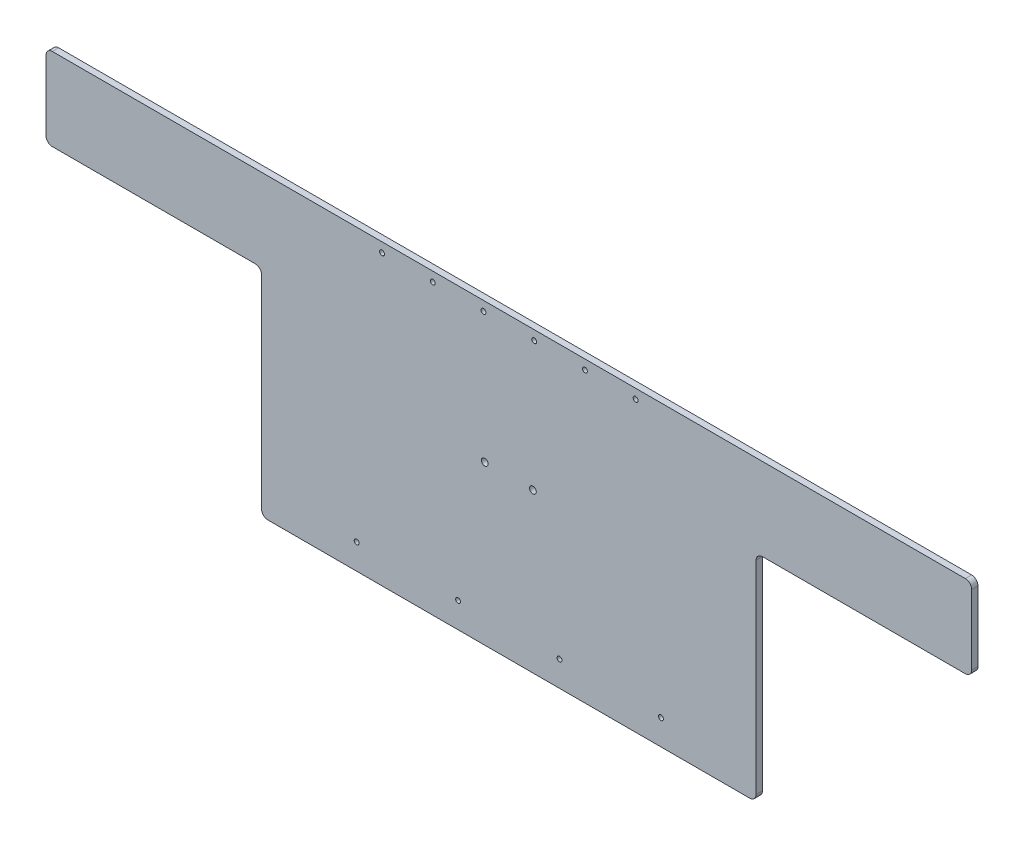
ISO-10303-21;
HEADER;
FILE_DESCRIPTION(('STEP AP214'),'2;1');
FILE_NAME('part.step','',(''),(''),'','','');
FILE_SCHEMA(('AUTOMOTIVE_DESIGN { 1 0 10303 214 1 1 1 1 }'));
ENDSEC;
DATA;
#1=APPLICATION_CONTEXT('core data for automotive mechanical design processes');
#2=APPLICATION_PROTOCOL_DEFINITION('international standard','automotive_design',2000,#1);
#3=PRODUCT_CONTEXT('',#1,'mechanical');
#4=PRODUCT('Part','Part','',(#3));
#5=PRODUCT_RELATED_PRODUCT_CATEGORY('part','',(#4));
#6=PRODUCT_DEFINITION_FORMATION('','',#4);
#7=PRODUCT_DEFINITION_CONTEXT('part definition',#1,'design');
#8=PRODUCT_DEFINITION('design','',#6,#7);
#9=PRODUCT_DEFINITION_SHAPE('','',#8);
#10=(LENGTH_UNIT() NAMED_UNIT(*) SI_UNIT(.MILLI.,.METRE.));
#11=(NAMED_UNIT(*) PLANE_ANGLE_UNIT() SI_UNIT($,.RADIAN.));
#12=(NAMED_UNIT(*) SI_UNIT($,.STERADIAN.) SOLID_ANGLE_UNIT());
#13=UNCERTAINTY_MEASURE_WITH_UNIT(LENGTH_MEASURE(1.E-05),#10,'distance_accuracy_value','');
#14=(GEOMETRIC_REPRESENTATION_CONTEXT(3) GLOBAL_UNCERTAINTY_ASSIGNED_CONTEXT((#13)) GLOBAL_UNIT_ASSIGNED_CONTEXT((#10,
#11,#12)) REPRESENTATION_CONTEXT('',''));
#15=CARTESIAN_POINT('',(0.,0.,0.));
#16=DIRECTION('',(0.,0.,1.));
#17=DIRECTION('',(1.,0.,0.));
#18=AXIS2_PLACEMENT_3D('',#15,#16,#17);
#19=CARTESIAN_POINT('',(152.4,-273.05,0.));
#20=DIRECTION('',(0.,0.,1.));
#21=DIRECTION('',(1.,0.,0.));
#22=AXIS2_PLACEMENT_3D('',#19,#20,#21);
#23=CYLINDRICAL_SURFACE('',#22,2.4638);
#24=CARTESIAN_POINT('',(152.4,-273.05,0.));
#25=DIRECTION('',(0.,0.,1.));
#26=DIRECTION('',(1.,0.,0.));
#27=AXIS2_PLACEMENT_3D('',#24,#25,#26);
#28=CIRCLE('',#27,2.4638);
#29=CARTESIAN_POINT('',(154.8638,-273.05,0.));
#30=VERTEX_POINT('',#29);
#31=EDGE_CURVE('E218',#30,#30,#28,.T.);
#32=ORIENTED_EDGE('',*,*,#31,.F.);
#33=EDGE_LOOP('',(#32));
#34=FACE_BOUND('',#33,.T.);
#35=CARTESIAN_POINT('',(152.4,-273.05,6.35));
#36=DIRECTION('',(0.,0.,1.));
#37=DIRECTION('',(1.,0.,0.));
#38=AXIS2_PLACEMENT_3D('',#35,#36,#37);
#39=CIRCLE('',#38,2.4638);
#40=CARTESIAN_POINT('',(154.8638,-273.05,6.35));
#41=VERTEX_POINT('',#40);
#42=EDGE_CURVE('E221',#41,#41,#39,.T.);
#43=ORIENTED_EDGE('',*,*,#42,.T.);
#44=EDGE_LOOP('',(#43));
#45=FACE_BOUND('',#44,.T.);
#46=ADVANCED_FACE('F37',(#34,#45),#23,.F.);
#47=CARTESIAN_POINT('',(50.8,-273.05,0.));
#48=DIRECTION('',(0.,0.,1.));
#49=DIRECTION('',(1.,0.,0.));
#50=AXIS2_PLACEMENT_3D('',#47,#48,#49);
#51=CYLINDRICAL_SURFACE('',#50,2.4638);
#52=CARTESIAN_POINT('',(50.8,-273.05,0.));
#53=DIRECTION('',(0.,0.,1.));
#54=DIRECTION('',(1.,0.,0.));
#55=AXIS2_PLACEMENT_3D('',#52,#53,#54);
#56=CIRCLE('',#55,2.4638);
#57=CARTESIAN_POINT('',(53.2638,-273.05,0.));
#58=VERTEX_POINT('',#57);
#59=EDGE_CURVE('E212',#58,#58,#56,.T.);
#60=ORIENTED_EDGE('',*,*,#59,.F.);
#61=EDGE_LOOP('',(#60));
#62=FACE_BOUND('',#61,.T.);
#63=CARTESIAN_POINT('',(50.8,-273.05,6.35));
#64=DIRECTION('',(0.,0.,1.));
#65=DIRECTION('',(1.,0.,0.));
#66=AXIS2_PLACEMENT_3D('',#63,#64,#65);
#67=CIRCLE('',#66,2.4638);
#68=CARTESIAN_POINT('',(53.2638,-273.05,6.35));
#69=VERTEX_POINT('',#68);
#70=EDGE_CURVE('E215',#69,#69,#67,.T.);
#71=ORIENTED_EDGE('',*,*,#70,.T.);
#72=EDGE_LOOP('',(#71));
#73=FACE_BOUND('',#72,.T.);
#74=ADVANCED_FACE('F343',(#62,#73),#51,.F.);
#75=CARTESIAN_POINT('',(-127.,-9.52500000000003,0.));
#76=DIRECTION('',(0.,0.,1.));
#77=DIRECTION('',(1.,0.,0.));
#78=AXIS2_PLACEMENT_3D('',#75,#76,#77);
#79=CYLINDRICAL_SURFACE('',#78,2.4638);
#80=CARTESIAN_POINT('',(-127.,-9.52500000000003,0.));
#81=DIRECTION('',(0.,0.,1.));
#82=DIRECTION('',(1.,0.,0.));
#83=AXIS2_PLACEMENT_3D('',#80,#81,#82);
#84=CIRCLE('',#83,2.4638);
#85=CARTESIAN_POINT('',(-124.5362,-9.52500000000003,0.));
#86=VERTEX_POINT('',#85);
#87=EDGE_CURVE('E206',#86,#86,#84,.T.);
#88=ORIENTED_EDGE('',*,*,#87,.F.);
#89=EDGE_LOOP('',(#88));
#90=FACE_BOUND('',#89,.T.);
#91=CARTESIAN_POINT('',(-127.,-9.52500000000003,6.35));
#92=DIRECTION('',(0.,0.,1.));
#93=DIRECTION('',(1.,0.,0.));
#94=AXIS2_PLACEMENT_3D('',#91,#92,#93);
#95=CIRCLE('',#94,2.4638);
#96=CARTESIAN_POINT('',(-124.5362,-9.52500000000003,6.35));
#97=VERTEX_POINT('',#96);
#98=EDGE_CURVE('E209',#97,#97,#95,.T.);
#99=ORIENTED_EDGE('',*,*,#98,.T.);
#100=EDGE_LOOP('',(#99));
#101=FACE_BOUND('',#100,.T.);
#102=ADVANCED_FACE('F349',(#90,#101),#79,.F.);
#103=CARTESIAN_POINT('',(-76.2,-9.52500000000003,0.));
#104=DIRECTION('',(0.,0.,1.));
#105=DIRECTION('',(1.,0.,0.));
#106=AXIS2_PLACEMENT_3D('',#103,#104,#105);
#107=CYLINDRICAL_SURFACE('',#106,2.4638);
#108=CARTESIAN_POINT('',(-76.2,-9.52500000000003,0.));
#109=DIRECTION('',(0.,0.,1.));
#110=DIRECTION('',(1.,0.,0.));
#111=AXIS2_PLACEMENT_3D('',#108,#109,#110);
#112=CIRCLE('',#111,2.4638);
#113=CARTESIAN_POINT('',(-73.7362,-9.52500000000003,0.));
#114=VERTEX_POINT('',#113);
#115=EDGE_CURVE('E200',#114,#114,#112,.T.);
#116=ORIENTED_EDGE('',*,*,#115,.F.);
#117=EDGE_LOOP('',(#116));
#118=FACE_BOUND('',#117,.T.);
#119=CARTESIAN_POINT('',(-76.2,-9.52500000000003,6.35));
#120=DIRECTION('',(0.,0.,1.));
#121=DIRECTION('',(1.,0.,0.));
#122=AXIS2_PLACEMENT_3D('',#119,#120,#121);
#123=CIRCLE('',#122,2.4638);
#124=CARTESIAN_POINT('',(-73.7362,-9.52500000000003,6.35));
#125=VERTEX_POINT('',#124);
#126=EDGE_CURVE('E203',#125,#125,#123,.T.);
#127=ORIENTED_EDGE('',*,*,#126,.T.);
#128=EDGE_LOOP('',(#127));
#129=FACE_BOUND('',#128,.T.);
#130=ADVANCED_FACE('F587',(#118,#129),#107,.F.);
#131=CARTESIAN_POINT('',(-25.4,-9.52500000000003,0.));
#132=DIRECTION('',(0.,0.,1.));
#133=DIRECTION('',(1.,0.,0.));
#134=AXIS2_PLACEMENT_3D('',#131,#132,#133);
#135=CYLINDRICAL_SURFACE('',#134,2.4638);
#136=CARTESIAN_POINT('',(-25.4,-9.52500000000003,0.));
#137=DIRECTION('',(0.,0.,1.));
#138=DIRECTION('',(1.,0.,0.));
#139=AXIS2_PLACEMENT_3D('',#136,#137,#138);
#140=CIRCLE('',#139,2.4638);
#141=CARTESIAN_POINT('',(-22.9362,-9.52500000000003,0.));
#142=VERTEX_POINT('',#141);
#143=EDGE_CURVE('E194',#142,#142,#140,.T.);
#144=ORIENTED_EDGE('',*,*,#143,.F.);
#145=EDGE_LOOP('',(#144));
#146=FACE_BOUND('',#145,.T.);
#147=CARTESIAN_POINT('',(-25.4,-9.52500000000003,6.35));
#148=DIRECTION('',(0.,0.,1.));
#149=DIRECTION('',(1.,0.,0.));
#150=AXIS2_PLACEMENT_3D('',#147,#148,#149);
#151=CIRCLE('',#150,2.4638);
#152=CARTESIAN_POINT('',(-22.9362,-9.52500000000003,6.35));
#153=VERTEX_POINT('',#152);
#154=EDGE_CURVE('E197',#153,#153,#151,.T.);
#155=ORIENTED_EDGE('',*,*,#154,.T.);
#156=EDGE_LOOP('',(#155));
#157=FACE_BOUND('',#156,.T.);
#158=ADVANCED_FACE('F577',(#146,#157),#135,.F.);
#159=CARTESIAN_POINT('',(25.4,-9.52500000000003,0.));
#160=DIRECTION('',(0.,0.,1.));
#161=DIRECTION('',(1.,0.,0.));
#162=AXIS2_PLACEMENT_3D('',#159,#160,#161);
#163=CYLINDRICAL_SURFACE('',#162,2.4638);
#164=CARTESIAN_POINT('',(25.4,-9.52500000000003,0.));
#165=DIRECTION('',(0.,0.,1.));
#166=DIRECTION('',(1.,0.,0.));
#167=AXIS2_PLACEMENT_3D('',#164,#165,#166);
#168=CIRCLE('',#167,2.4638);
#169=CARTESIAN_POINT('',(27.8638,-9.52500000000003,0.));
#170=VERTEX_POINT('',#169);
#171=EDGE_CURVE('E188',#170,#170,#168,.T.);
#172=ORIENTED_EDGE('',*,*,#171,.F.);
#173=EDGE_LOOP('',(#172));
#174=FACE_BOUND('',#173,.T.);
#175=CARTESIAN_POINT('',(25.4,-9.52500000000003,6.35));
#176=DIRECTION('',(0.,0.,1.));
#177=DIRECTION('',(1.,0.,0.));
#178=AXIS2_PLACEMENT_3D('',#175,#176,#177);
#179=CIRCLE('',#178,2.4638);
#180=CARTESIAN_POINT('',(27.8638,-9.52500000000003,6.35));
#181=VERTEX_POINT('',#180);
#182=EDGE_CURVE('E191',#181,#181,#179,.T.);
#183=ORIENTED_EDGE('',*,*,#182,.T.);
#184=EDGE_LOOP('',(#183));
#185=FACE_BOUND('',#184,.T.);
#186=ADVANCED_FACE('F509',(#174,#185),#163,.F.);
#187=CARTESIAN_POINT('',(-247.65,-82.5500000000001,6.35));
#188=DIRECTION('',(0.,1.,0.));
#189=DIRECTION('',(-1.,0.,0.));
#190=AXIS2_PLACEMENT_3D('',#187,#188,#189);
#191=PLANE('',#190);
#192=DIRECTION('',(1.,0.,0.));
#193=VECTOR('',#192,1.);
#194=CARTESIAN_POINT('',(-247.65,-82.5500000000001,6.35));
#195=LINE('',#194,#193);
#196=CARTESIAN_POINT('',(-457.2,-82.5500000000002,6.35));
#197=VERTEX_POINT('',#196);
#198=CARTESIAN_POINT('',(-254.,-82.5500000000001,6.35));
#199=VERTEX_POINT('',#198);
#200=EDGE_CURVE('E178',#197,#199,#195,.T.);
#201=ORIENTED_EDGE('',*,*,#200,.F.);
#202=DIRECTION('',(0.,0.,-1.));
#203=VECTOR('',#202,1.);
#204=CARTESIAN_POINT('',(-457.2,-82.5500000000002,6.35));
#205=LINE('',#204,#203);
#206=CARTESIAN_POINT('',(-457.2,-82.5500000000002,0.));
#207=VERTEX_POINT('',#206);
#208=EDGE_CURVE('E249',#197,#207,#205,.T.);
#209=ORIENTED_EDGE('',*,*,#208,.T.);
#210=DIRECTION('',(1.,0.,0.));
#211=VECTOR('',#210,1.);
#212=CARTESIAN_POINT('',(-247.65,-82.5500000000001,0.));
#213=LINE('',#212,#211);
#214=CARTESIAN_POINT('',(-254.,-82.5500000000001,0.));
#215=VERTEX_POINT('',#214);
#216=EDGE_CURVE('E315',#207,#215,#213,.T.);
#217=ORIENTED_EDGE('',*,*,#216,.T.);
#218=DIRECTION('',(0.,0.,-1.));
#219=VECTOR('',#218,1.);
#220=CARTESIAN_POINT('',(-254.,-82.5500000000001,6.35));
#221=LINE('',#220,#219);
#222=EDGE_CURVE('E247',#215,#199,#221,.F.);
#223=ORIENTED_EDGE('',*,*,#222,.T.);
#224=EDGE_LOOP('',(#201,#209,#217,#223));
#225=FACE_BOUND('',#224,.T.);
#226=ADVANCED_FACE('F499',(#225),#191,.F.);
#227=CARTESIAN_POINT('',(-247.65,-298.45,6.35));
#228=DIRECTION('',(1.,0.,0.));
#229=DIRECTION('',(0.,1.,0.));
#230=AXIS2_PLACEMENT_3D('',#227,#228,#229);
#231=PLANE('',#230);
#232=DIRECTION('',(0.,-1.,0.));
#233=VECTOR('',#232,1.);
#234=CARTESIAN_POINT('',(-247.65,-298.45,6.35));
#235=LINE('',#234,#233);
#236=CARTESIAN_POINT('',(-247.65,-88.9000000000001,6.35));
#237=VERTEX_POINT('',#236);
#238=CARTESIAN_POINT('',(-247.65,-292.1,6.35));
#239=VERTEX_POINT('',#238);
#240=EDGE_CURVE('E182',#237,#239,#235,.T.);
#241=ORIENTED_EDGE('',*,*,#240,.F.);
#242=DIRECTION('',(0.,0.,-1.));
#243=VECTOR('',#242,1.);
#244=CARTESIAN_POINT('',(-247.65,-88.9000000000001,0.));
#245=LINE('',#244,#243);
#246=CARTESIAN_POINT('',(-247.65,-88.9000000000001,0.));
#247=VERTEX_POINT('',#246);
#248=EDGE_CURVE('E254',#237,#247,#245,.T.);
#249=ORIENTED_EDGE('',*,*,#248,.T.);
#250=DIRECTION('',(0.,-1.,0.));
#251=VECTOR('',#250,1.);
#252=CARTESIAN_POINT('',(-247.65,-298.45,0.));
#253=LINE('',#252,#251);
#254=CARTESIAN_POINT('',(-247.65,-292.1,0.));
#255=VERTEX_POINT('',#254);
#256=EDGE_CURVE('E318',#247,#255,#253,.T.);
#257=ORIENTED_EDGE('',*,*,#256,.T.);
#258=DIRECTION('',(0.,0.,-1.));
#259=VECTOR('',#258,1.);
#260=CARTESIAN_POINT('',(-247.65,-292.1,6.35));
#261=LINE('',#260,#259);
#262=EDGE_CURVE('E252',#255,#239,#261,.F.);
#263=ORIENTED_EDGE('',*,*,#262,.T.);
#264=EDGE_LOOP('',(#241,#249,#257,#263));
#265=FACE_BOUND('',#264,.T.);
#266=ADVANCED_FACE('F489',(#265),#231,.F.);
#267=CARTESIAN_POINT('',(247.65,-298.45,6.35));
#268=DIRECTION('',(0.,1.,0.));
#269=DIRECTION('',(0.,0.,1.));
#270=AXIS2_PLACEMENT_3D('',#267,#268,#269);
#271=PLANE('',#270);
#272=DIRECTION('',(1.,0.,0.));
#273=VECTOR('',#272,1.);
#274=CARTESIAN_POINT('',(247.65,-298.45,6.35));
#275=LINE('',#274,#273);
#276=CARTESIAN_POINT('',(-241.3,-298.45,6.35));
#277=VERTEX_POINT('',#276);
#278=CARTESIAN_POINT('',(241.3,-298.45,6.35));
#279=VERTEX_POINT('',#278);
#280=EDGE_CURVE('E309',#277,#279,#275,.T.);
#281=ORIENTED_EDGE('',*,*,#280,.F.);
#282=DIRECTION('',(0.,0.,-1.));
#283=VECTOR('',#282,1.);
#284=CARTESIAN_POINT('',(-241.3,-298.45,6.35));
#285=LINE('',#284,#283);
#286=CARTESIAN_POINT('',(-241.3,-298.45,0.));
#287=VERTEX_POINT('',#286);
#288=EDGE_CURVE('E259',#277,#287,#285,.T.);
#289=ORIENTED_EDGE('',*,*,#288,.T.);
#290=DIRECTION('',(1.,0.,0.));
#291=VECTOR('',#290,1.);
#292=CARTESIAN_POINT('',(247.65,-298.45,0.));
#293=LINE('',#292,#291);
#294=CARTESIAN_POINT('',(241.3,-298.45,0.));
#295=VERTEX_POINT('',#294);
#296=EDGE_CURVE('E293',#287,#295,#293,.T.);
#297=ORIENTED_EDGE('',*,*,#296,.T.);
#298=DIRECTION('',(0.,0.,-1.));
#299=VECTOR('',#298,1.);
#300=CARTESIAN_POINT('',(241.3,-298.45,6.35));
#301=LINE('',#300,#299);
#302=EDGE_CURVE('E257',#295,#279,#301,.F.);
#303=ORIENTED_EDGE('',*,*,#302,.T.);
#304=EDGE_LOOP('',(#281,#289,#297,#303));
#305=FACE_BOUND('',#304,.T.);
#306=ADVANCED_FACE('F480',(#305),#271,.F.);
#307=CARTESIAN_POINT('',(247.65,-82.5500000000001,6.35));
#308=DIRECTION('',(-1.,0.,0.));
#309=DIRECTION('',(0.,-1.,0.));
#310=AXIS2_PLACEMENT_3D('',#307,#308,#309);
#311=PLANE('',#310);
#312=DIRECTION('',(0.,1.,0.));
#313=VECTOR('',#312,1.);
#314=CARTESIAN_POINT('',(247.65,-82.5500000000001,6.35));
#315=LINE('',#314,#313);
#316=CARTESIAN_POINT('',(247.65,-292.1,6.35));
#317=VERTEX_POINT('',#316);
#318=CARTESIAN_POINT('',(247.65,-88.9000000000001,6.35));
#319=VERTEX_POINT('',#318);
#320=EDGE_CURVE('E301',#317,#319,#315,.T.);
#321=ORIENTED_EDGE('',*,*,#320,.F.);
#322=DIRECTION('',(0.,0.,-1.));
#323=VECTOR('',#322,1.);
#324=CARTESIAN_POINT('',(247.65,-292.1,6.35));
#325=LINE('',#324,#323);
#326=CARTESIAN_POINT('',(247.65,-292.1,0.));
#327=VERTEX_POINT('',#326);
#328=EDGE_CURVE('E264',#317,#327,#325,.T.);
#329=ORIENTED_EDGE('',*,*,#328,.T.);
#330=DIRECTION('',(0.,1.,0.));
#331=VECTOR('',#330,1.);
#332=CARTESIAN_POINT('',(247.65,-82.5500000000001,0.));
#333=LINE('',#332,#331);
#334=CARTESIAN_POINT('',(247.65,-88.9000000000001,0.));
#335=VERTEX_POINT('',#334);
#336=EDGE_CURVE('E282',#327,#335,#333,.T.);
#337=ORIENTED_EDGE('',*,*,#336,.T.);
#338=DIRECTION('',(0.,0.,-1.));
#339=VECTOR('',#338,1.);
#340=CARTESIAN_POINT('',(247.65,-88.9000000000001,6.35));
#341=LINE('',#340,#339);
#342=EDGE_CURVE('E262',#335,#319,#341,.F.);
#343=ORIENTED_EDGE('',*,*,#342,.T.);
#344=EDGE_LOOP('',(#321,#329,#337,#343));
#345=FACE_BOUND('',#344,.T.);
#346=ADVANCED_FACE('F290',(#345),#311,.F.);
#347=CARTESIAN_POINT('',(463.55,-82.5500000000002,6.35));
#348=DIRECTION('',(0.,1.,0.));
#349=DIRECTION('',(-1.,0.,0.));
#350=AXIS2_PLACEMENT_3D('',#347,#348,#349);
#351=PLANE('',#350);
#352=DIRECTION('',(1.,0.,0.));
#353=VECTOR('',#352,1.);
#354=CARTESIAN_POINT('',(463.55,-82.5500000000002,0.));
#355=LINE('',#354,#353);
#356=CARTESIAN_POINT('',(254.,-82.5500000000001,0.));
#357=VERTEX_POINT('',#356);
#358=CARTESIAN_POINT('',(457.2,-82.5500000000002,0.));
#359=VERTEX_POINT('',#358);
#360=EDGE_CURVE('E284',#357,#359,#355,.T.);
#361=ORIENTED_EDGE('',*,*,#360,.T.);
#362=DIRECTION('',(0.,0.,-1.));
#363=VECTOR('',#362,1.);
#364=CARTESIAN_POINT('',(457.2,-82.5500000000002,6.35));
#365=LINE('',#364,#363);
#366=CARTESIAN_POINT('',(457.2,-82.5500000000002,6.35));
#367=VERTEX_POINT('',#366);
#368=EDGE_CURVE('E274',#359,#367,#365,.F.);
#369=ORIENTED_EDGE('',*,*,#368,.T.);
#370=DIRECTION('',(1.,0.,0.));
#371=VECTOR('',#370,1.);
#372=CARTESIAN_POINT('',(463.55,-82.5500000000002,6.35));
#373=LINE('',#372,#371);
#374=CARTESIAN_POINT('',(254.,-82.5500000000001,6.35));
#375=VERTEX_POINT('',#374);
#376=EDGE_CURVE('E300',#375,#367,#373,.T.);
#377=ORIENTED_EDGE('',*,*,#376,.F.);
#378=DIRECTION('',(0.,0.,-1.));
#379=VECTOR('',#378,1.);
#380=CARTESIAN_POINT('',(254.,-82.5500000000001,0.));
#381=LINE('',#380,#379);
#382=EDGE_CURVE('E271',#375,#357,#381,.T.);
#383=ORIENTED_EDGE('',*,*,#382,.T.);
#384=EDGE_LOOP('',(#361,#369,#377,#383));
#385=FACE_BOUND('',#384,.T.);
#386=ADVANCED_FACE('F303',(#385),#351,.F.);
#387=CARTESIAN_POINT('',(463.55,0.,6.35));
#388=DIRECTION('',(-1.,0.,0.));
#389=DIRECTION('',(0.,0.,1.));
#390=AXIS2_PLACEMENT_3D('',#387,#388,#389);
#391=PLANE('',#390);
#392=DIRECTION('',(0.,1.,0.));
#393=VECTOR('',#392,1.);
#394=CARTESIAN_POINT('',(463.55,0.,0.));
#395=LINE('',#394,#393);
#396=CARTESIAN_POINT('',(463.55,-76.2000000000002,0.));
#397=VERTEX_POINT('',#396);
#398=CARTESIAN_POINT('',(463.55,-6.35000000000003,0.));
#399=VERTEX_POINT('',#398);
#400=EDGE_CURVE('E184',#397,#399,#395,.T.);
#401=ORIENTED_EDGE('',*,*,#400,.T.);
#402=DIRECTION('',(0.,0.,-1.));
#403=VECTOR('',#402,1.);
#404=CARTESIAN_POINT('',(463.55,-6.35000000000003,6.35));
#405=LINE('',#404,#403);
#406=CARTESIAN_POINT('',(463.55,-6.35000000000003,6.35));
#407=VERTEX_POINT('',#406);
#408=EDGE_CURVE('E52',#399,#407,#405,.F.);
#409=ORIENTED_EDGE('',*,*,#408,.T.);
#410=DIRECTION('',(0.,1.,0.));
#411=VECTOR('',#410,1.);
#412=CARTESIAN_POINT('',(463.55,0.,6.35));
#413=LINE('',#412,#411);
#414=CARTESIAN_POINT('',(463.55,-76.2000000000002,6.35));
#415=VERTEX_POINT('',#414);
#416=EDGE_CURVE('E305',#415,#407,#413,.T.);
#417=ORIENTED_EDGE('',*,*,#416,.F.);
#418=DIRECTION('',(0.,0.,-1.));
#419=VECTOR('',#418,1.);
#420=CARTESIAN_POINT('',(463.55,-76.2000000000002,6.35));
#421=LINE('',#420,#419);
#422=EDGE_CURVE('E267',#415,#397,#421,.T.);
#423=ORIENTED_EDGE('',*,*,#422,.T.);
#424=EDGE_LOOP('',(#401,#409,#417,#423));
#425=FACE_BOUND('',#424,.T.);
#426=ADVANCED_FACE('F325',(#425),#391,.F.);
#427=CARTESIAN_POINT('',(-463.55,0.,6.35));
#428=DIRECTION('',(0.,-1.,0.));
#429=DIRECTION('',(0.,0.,-1.));
#430=AXIS2_PLACEMENT_3D('',#427,#428,#429);
#431=PLANE('',#430);
#432=DIRECTION('',(-1.,0.,0.));
#433=VECTOR('',#432,1.);
#434=CARTESIAN_POINT('',(-463.55,0.,0.));
#435=LINE('',#434,#433);
#436=CARTESIAN_POINT('',(457.2,0.,0.));
#437=VERTEX_POINT('',#436);
#438=CARTESIAN_POINT('',(-457.2,0.,0.));
#439=VERTEX_POINT('',#438);
#440=EDGE_CURVE('E179',#437,#439,#435,.T.);
#441=ORIENTED_EDGE('',*,*,#440,.T.);
#442=DIRECTION('',(0.,0.,-1.));
#443=VECTOR('',#442,1.);
#444=CARTESIAN_POINT('',(-457.2,0.,6.35));
#445=LINE('',#444,#443);
#446=CARTESIAN_POINT('',(-457.2,0.,6.35));
#447=VERTEX_POINT('',#446);
#448=EDGE_CURVE('E156',#439,#447,#445,.F.);
#449=ORIENTED_EDGE('',*,*,#448,.T.);
#450=DIRECTION('',(-1.,0.,0.));
#451=VECTOR('',#450,1.);
#452=CARTESIAN_POINT('',(-463.55,0.,6.35));
#453=LINE('',#452,#451);
#454=CARTESIAN_POINT('',(457.2,0.,6.35));
#455=VERTEX_POINT('',#454);
#456=EDGE_CURVE('E307',#455,#447,#453,.T.);
#457=ORIENTED_EDGE('',*,*,#456,.F.);
#458=DIRECTION('',(0.,0.,-1.));
#459=VECTOR('',#458,1.);
#460=CARTESIAN_POINT('',(457.2,0.,6.35));
#461=LINE('',#460,#459);
#462=EDGE_CURVE('E161',#455,#437,#461,.T.);
#463=ORIENTED_EDGE('',*,*,#462,.T.);
#464=EDGE_LOOP('',(#441,#449,#457,#463));
#465=FACE_BOUND('',#464,.T.);
#466=ADVANCED_FACE('F333',(#465),#431,.F.);
#467=CARTESIAN_POINT('',(-463.55,-82.5500000000002,6.35));
#468=DIRECTION('',(1.,0.,0.));
#469=DIRECTION('',(0.,0.,-1.));
#470=AXIS2_PLACEMENT_3D('',#467,#468,#469);
#471=PLANE('',#470);
#472=DIRECTION('',(0.,-1.,0.));
#473=VECTOR('',#472,1.);
#474=CARTESIAN_POINT('',(-463.55,-82.5500000000002,6.35));
#475=LINE('',#474,#473);
#476=CARTESIAN_POINT('',(-463.55,-6.35000000000002,6.35));
#477=VERTEX_POINT('',#476);
#478=CARTESIAN_POINT('',(-463.55,-76.2000000000002,6.35));
#479=VERTEX_POINT('',#478);
#480=EDGE_CURVE('E171',#477,#479,#475,.T.);
#481=ORIENTED_EDGE('',*,*,#480,.F.);
#482=DIRECTION('',(0.,0.,-1.));
#483=VECTOR('',#482,1.);
#484=CARTESIAN_POINT('',(-463.55,-6.35000000000002,6.35));
#485=LINE('',#484,#483);
#486=CARTESIAN_POINT('',(-463.55,-6.35000000000002,0.));
#487=VERTEX_POINT('',#486);
#488=EDGE_CURVE('E155',#477,#487,#485,.T.);
#489=ORIENTED_EDGE('',*,*,#488,.T.);
#490=DIRECTION('',(0.,-1.,0.));
#491=VECTOR('',#490,1.);
#492=CARTESIAN_POINT('',(-463.55,-82.5500000000002,0.));
#493=LINE('',#492,#491);
#494=CARTESIAN_POINT('',(-463.55,-76.2000000000002,0.));
#495=VERTEX_POINT('',#494);
#496=EDGE_CURVE('E168',#487,#495,#493,.T.);
#497=ORIENTED_EDGE('',*,*,#496,.T.);
#498=DIRECTION('',(0.,0.,-1.));
#499=VECTOR('',#498,1.);
#500=CARTESIAN_POINT('',(-463.55,-76.2000000000002,6.35));
#501=LINE('',#500,#499);
#502=EDGE_CURVE('E173',#495,#479,#501,.F.);
#503=ORIENTED_EDGE('',*,*,#502,.T.);
#504=EDGE_LOOP('',(#481,#489,#497,#503));
#505=FACE_BOUND('',#504,.T.);
#506=ADVANCED_FACE('F167',(#505),#471,.F.);
#507=CARTESIAN_POINT('',(0.,0.,6.35));
#508=DIRECTION('',(0.,0.,-1.));
#509=DIRECTION('',(-1.,0.,0.));
#510=AXIS2_PLACEMENT_3D('',#507,#508,#509);
#511=PLANE('',#510);
#512=CARTESIAN_POINT('',(-24.13,-139.7,6.35));
#513=DIRECTION('',(0.,0.,1.));
#514=DIRECTION('',(1.,0.,0.));
#515=AXIS2_PLACEMENT_3D('',#512,#513,#514);
#516=CIRCLE('',#515,3.3655);
#517=CARTESIAN_POINT('',(-20.7645,-139.7,6.35));
#518=VERTEX_POINT('',#517);
#519=EDGE_CURVE('E668',#518,#518,#516,.T.);
#520=ORIENTED_EDGE('',*,*,#519,.F.);
#521=EDGE_LOOP('',(#520));
#522=FACE_BOUND('',#521,.T.);
#523=CARTESIAN_POINT('',(24.13,-139.7,6.35));
#524=DIRECTION('',(0.,0.,1.));
#525=DIRECTION('',(1.,0.,0.));
#526=AXIS2_PLACEMENT_3D('',#523,#524,#525);
#527=CIRCLE('',#526,3.3655);
#528=CARTESIAN_POINT('',(27.4955,-139.7,6.35));
#529=VERTEX_POINT('',#528);
#530=EDGE_CURVE('E662',#529,#529,#527,.T.);
#531=ORIENTED_EDGE('',*,*,#530,.F.);
#532=EDGE_LOOP('',(#531));
#533=FACE_BOUND('',#532,.T.);
#534=CARTESIAN_POINT('',(-50.8,-273.05,6.35));
#535=DIRECTION('',(0.,0.,1.));
#536=DIRECTION('',(1.,0.,0.));
#537=AXIS2_PLACEMENT_3D('',#534,#535,#536);
#538=CIRCLE('',#537,2.4638);
#539=CARTESIAN_POINT('',(-48.3362,-273.05,6.35));
#540=VERTEX_POINT('',#539);
#541=EDGE_CURVE('E653',#540,#540,#538,.T.);
#542=ORIENTED_EDGE('',*,*,#541,.F.);
#543=EDGE_LOOP('',(#542));
#544=FACE_BOUND('',#543,.T.);
#545=CARTESIAN_POINT('',(-152.4,-273.05,6.35));
#546=DIRECTION('',(0.,0.,1.));
#547=DIRECTION('',(1.,0.,0.));
#548=AXIS2_PLACEMENT_3D('',#545,#546,#547);
#549=CIRCLE('',#548,2.4638);
#550=CARTESIAN_POINT('',(-149.9362,-273.05,6.35));
#551=VERTEX_POINT('',#550);
#552=EDGE_CURVE('E650',#551,#551,#549,.T.);
#553=ORIENTED_EDGE('',*,*,#552,.F.);
#554=EDGE_LOOP('',(#553));
#555=FACE_BOUND('',#554,.T.);
#556=CARTESIAN_POINT('',(76.2,-9.52500000000003,6.35));
#557=DIRECTION('',(0.,0.,1.));
#558=DIRECTION('',(1.,0.,0.));
#559=AXIS2_PLACEMENT_3D('',#556,#557,#558);
#560=CIRCLE('',#559,2.4638);
#561=CARTESIAN_POINT('',(78.6638,-9.52500000000003,6.35));
#562=VERTEX_POINT('',#561);
#563=EDGE_CURVE('E622',#562,#562,#560,.T.);
#564=ORIENTED_EDGE('',*,*,#563,.F.);
#565=EDGE_LOOP('',(#564));
#566=FACE_BOUND('',#565,.T.);
#567=CARTESIAN_POINT('',(127.,-9.52500000000003,6.35));
#568=DIRECTION('',(0.,0.,1.));
#569=DIRECTION('',(1.,0.,0.));
#570=AXIS2_PLACEMENT_3D('',#567,#568,#569);
#571=CIRCLE('',#570,2.4638);
#572=CARTESIAN_POINT('',(129.4638,-9.52500000000003,6.35));
#573=VERTEX_POINT('',#572);
#574=EDGE_CURVE('E620',#573,#573,#571,.T.);
#575=ORIENTED_EDGE('',*,*,#574,.F.);
#576=EDGE_LOOP('',(#575));
#577=FACE_BOUND('',#576,.T.);
#578=ORIENTED_EDGE('',*,*,#456,.T.);
#579=CARTESIAN_POINT('',(-457.2,-6.35000000000002,6.35));
#580=DIRECTION('',(0.,0.,-1.));
#581=DIRECTION('',(-1.,0.,0.));
#582=AXIS2_PLACEMENT_3D('',#579,#580,#581);
#583=CIRCLE('',#582,6.35);
#584=EDGE_CURVE('E245',#447,#477,#583,.F.);
#585=ORIENTED_EDGE('',*,*,#584,.T.);
#586=ORIENTED_EDGE('',*,*,#480,.T.);
#587=CARTESIAN_POINT('',(-457.2,-76.2000000000002,6.35));
#588=DIRECTION('',(0.,0.,-1.));
#589=DIRECTION('',(-1.,0.,0.));
#590=AXIS2_PLACEMENT_3D('',#587,#588,#589);
#591=CIRCLE('',#590,6.35);
#592=EDGE_CURVE('E243',#479,#197,#591,.F.);
#593=ORIENTED_EDGE('',*,*,#592,.T.);
#594=ORIENTED_EDGE('',*,*,#200,.T.);
#595=CARTESIAN_POINT('',(-254.,-88.9000000000001,6.35));
#596=DIRECTION('',(0.,0.,-1.));
#597=DIRECTION('',(-1.,0.,0.));
#598=AXIS2_PLACEMENT_3D('',#595,#596,#597);
#599=CIRCLE('',#598,6.35);
#600=EDGE_CURVE('E278',#199,#237,#599,.T.);
#601=ORIENTED_EDGE('',*,*,#600,.T.);
#602=ORIENTED_EDGE('',*,*,#240,.T.);
#603=CARTESIAN_POINT('',(-241.3,-292.1,6.35));
#604=DIRECTION('',(0.,0.,-1.));
#605=DIRECTION('',(-1.,0.,0.));
#606=AXIS2_PLACEMENT_3D('',#603,#604,#605);
#607=CIRCLE('',#606,6.35);
#608=EDGE_CURVE('E241',#239,#277,#607,.F.);
#609=ORIENTED_EDGE('',*,*,#608,.T.);
#610=ORIENTED_EDGE('',*,*,#280,.T.);
#611=CARTESIAN_POINT('',(241.3,-292.1,6.35));
#612=DIRECTION('',(0.,0.,-1.));
#613=DIRECTION('',(-1.,0.,0.));
#614=AXIS2_PLACEMENT_3D('',#611,#612,#613);
#615=CIRCLE('',#614,6.35);
#616=EDGE_CURVE('E239',#279,#317,#615,.F.);
#617=ORIENTED_EDGE('',*,*,#616,.T.);
#618=ORIENTED_EDGE('',*,*,#320,.T.);
#619=CARTESIAN_POINT('',(254.,-88.9000000000001,6.35));
#620=DIRECTION('',(0.,0.,-1.));
#621=DIRECTION('',(-1.,0.,0.));
#622=AXIS2_PLACEMENT_3D('',#619,#620,#621);
#623=CIRCLE('',#622,6.35);
#624=EDGE_CURVE('E11',#319,#375,#623,.T.);
#625=ORIENTED_EDGE('',*,*,#624,.T.);
#626=ORIENTED_EDGE('',*,*,#376,.T.);
#627=CARTESIAN_POINT('',(457.2,-76.2000000000002,6.35));
#628=DIRECTION('',(0.,0.,-1.));
#629=DIRECTION('',(-1.,0.,0.));
#630=AXIS2_PLACEMENT_3D('',#627,#628,#629);
#631=CIRCLE('',#630,6.35);
#632=EDGE_CURVE('E59',#367,#415,#631,.F.);
#633=ORIENTED_EDGE('',*,*,#632,.T.);
#634=ORIENTED_EDGE('',*,*,#416,.T.);
#635=CARTESIAN_POINT('',(457.2,-6.35000000000003,6.35));
#636=DIRECTION('',(0.,0.,-1.));
#637=DIRECTION('',(-1.,0.,0.));
#638=AXIS2_PLACEMENT_3D('',#635,#636,#637);
#639=CIRCLE('',#638,6.35);
#640=EDGE_CURVE('E237',#407,#455,#639,.F.);
#641=ORIENTED_EDGE('',*,*,#640,.T.);
#642=EDGE_LOOP('',(#578,#585,#586,#593,#594,#601,#602,#609,#610,#617,#618,#625,#626,#633,#634,#641));
#643=FACE_BOUND('',#642,.T.);
#644=ORIENTED_EDGE('',*,*,#182,.F.);
#645=EDGE_LOOP('',(#644));
#646=FACE_BOUND('',#645,.T.);
#647=ORIENTED_EDGE('',*,*,#154,.F.);
#648=EDGE_LOOP('',(#647));
#649=FACE_BOUND('',#648,.T.);
#650=ORIENTED_EDGE('',*,*,#126,.F.);
#651=EDGE_LOOP('',(#650));
#652=FACE_BOUND('',#651,.T.);
#653=ORIENTED_EDGE('',*,*,#98,.F.);
#654=EDGE_LOOP('',(#653));
#655=FACE_BOUND('',#654,.T.);
#656=ORIENTED_EDGE('',*,*,#70,.F.);
#657=EDGE_LOOP('',(#656));
#658=FACE_BOUND('',#657,.T.);
#659=ORIENTED_EDGE('',*,*,#42,.F.);
#660=EDGE_LOOP('',(#659));
#661=FACE_BOUND('',#660,.T.);
#662=ADVANCED_FACE('F298',(#522,#533,#544,#555,#566,#577,#643,#646,#649,#652,#655,#658,#661),
#511,.F.);
#663=CARTESIAN_POINT('',(0.,0.,0.));
#664=DIRECTION('',(0.,0.,-1.));
#665=DIRECTION('',(-1.,0.,0.));
#666=AXIS2_PLACEMENT_3D('',#663,#664,#665);
#667=PLANE('',#666);
#668=CARTESIAN_POINT('',(-24.13,-139.7,0.));
#669=DIRECTION('',(0.,0.,1.));
#670=DIRECTION('',(1.,0.,0.));
#671=AXIS2_PLACEMENT_3D('',#668,#669,#670);
#672=CIRCLE('',#671,3.3655);
#673=CARTESIAN_POINT('',(-20.7645,-139.7,0.));
#674=VERTEX_POINT('',#673);
#675=EDGE_CURVE('E661',#674,#674,#672,.T.);
#676=ORIENTED_EDGE('',*,*,#675,.T.);
#677=EDGE_LOOP('',(#676));
#678=FACE_BOUND('',#677,.T.);
#679=CARTESIAN_POINT('',(24.13,-139.7,0.));
#680=DIRECTION('',(0.,0.,1.));
#681=DIRECTION('',(1.,0.,0.));
#682=AXIS2_PLACEMENT_3D('',#679,#680,#681);
#683=CIRCLE('',#682,3.3655);
#684=CARTESIAN_POINT('',(27.4955,-139.7,0.));
#685=VERTEX_POINT('',#684);
#686=EDGE_CURVE('E665',#685,#685,#683,.T.);
#687=ORIENTED_EDGE('',*,*,#686,.T.);
#688=EDGE_LOOP('',(#687));
#689=FACE_BOUND('',#688,.T.);
#690=CARTESIAN_POINT('',(-50.8,-273.05,0.));
#691=DIRECTION('',(0.,0.,1.));
#692=DIRECTION('',(1.,0.,0.));
#693=AXIS2_PLACEMENT_3D('',#690,#691,#692);
#694=CIRCLE('',#693,2.4638);
#695=CARTESIAN_POINT('',(-48.3362,-273.05,0.));
#696=VERTEX_POINT('',#695);
#697=EDGE_CURVE('E658',#696,#696,#694,.T.);
#698=ORIENTED_EDGE('',*,*,#697,.T.);
#699=EDGE_LOOP('',(#698));
#700=FACE_BOUND('',#699,.T.);
#701=CARTESIAN_POINT('',(-152.4,-273.05,0.));
#702=DIRECTION('',(0.,0.,1.));
#703=DIRECTION('',(1.,0.,0.));
#704=AXIS2_PLACEMENT_3D('',#701,#702,#703);
#705=CIRCLE('',#704,2.4638);
#706=CARTESIAN_POINT('',(-149.9362,-273.05,0.));
#707=VERTEX_POINT('',#706);
#708=EDGE_CURVE('E649',#707,#707,#705,.T.);
#709=ORIENTED_EDGE('',*,*,#708,.T.);
#710=EDGE_LOOP('',(#709));
#711=FACE_BOUND('',#710,.T.);
#712=CARTESIAN_POINT('',(76.2,-9.52500000000003,0.));
#713=DIRECTION('',(0.,0.,1.));
#714=DIRECTION('',(1.,0.,0.));
#715=AXIS2_PLACEMENT_3D('',#712,#713,#714);
#716=CIRCLE('',#715,2.4638);
#717=CARTESIAN_POINT('',(78.6638,-9.52500000000003,0.));
#718=VERTEX_POINT('',#717);
#719=EDGE_CURVE('E626',#718,#718,#716,.T.);
#720=ORIENTED_EDGE('',*,*,#719,.T.);
#721=EDGE_LOOP('',(#720));
#722=FACE_BOUND('',#721,.T.);
#723=CARTESIAN_POINT('',(127.,-9.52500000000003,0.));
#724=DIRECTION('',(0.,0.,1.));
#725=DIRECTION('',(1.,0.,0.));
#726=AXIS2_PLACEMENT_3D('',#723,#724,#725);
#727=CIRCLE('',#726,2.4638);
#728=CARTESIAN_POINT('',(129.4638,-9.52500000000003,0.));
#729=VERTEX_POINT('',#728);
#730=EDGE_CURVE('E319',#729,#729,#727,.T.);
#731=ORIENTED_EDGE('',*,*,#730,.T.);
#732=EDGE_LOOP('',(#731));
#733=FACE_BOUND('',#732,.T.);
#734=ORIENTED_EDGE('',*,*,#496,.F.);
#735=CARTESIAN_POINT('',(-457.2,-6.35000000000002,0.));
#736=DIRECTION('',(0.,0.,-1.));
#737=DIRECTION('',(-1.,0.,0.));
#738=AXIS2_PLACEMENT_3D('',#735,#736,#737);
#739=CIRCLE('',#738,6.35);
#740=EDGE_CURVE('E151',#487,#439,#739,.T.);
#741=ORIENTED_EDGE('',*,*,#740,.T.);
#742=ORIENTED_EDGE('',*,*,#440,.F.);
#743=CARTESIAN_POINT('',(457.2,-6.35000000000003,0.));
#744=DIRECTION('',(0.,0.,-1.));
#745=DIRECTION('',(-1.,0.,0.));
#746=AXIS2_PLACEMENT_3D('',#743,#744,#745);
#747=CIRCLE('',#746,6.35);
#748=EDGE_CURVE('E226',#437,#399,#747,.T.);
#749=ORIENTED_EDGE('',*,*,#748,.T.);
#750=ORIENTED_EDGE('',*,*,#400,.F.);
#751=CARTESIAN_POINT('',(457.2,-76.2000000000002,0.));
#752=DIRECTION('',(0.,0.,-1.));
#753=DIRECTION('',(-1.,0.,0.));
#754=AXIS2_PLACEMENT_3D('',#751,#752,#753);
#755=CIRCLE('',#754,6.35);
#756=EDGE_CURVE('E172',#397,#359,#755,.T.);
#757=ORIENTED_EDGE('',*,*,#756,.T.);
#758=ORIENTED_EDGE('',*,*,#360,.F.);
#759=CARTESIAN_POINT('',(254.,-88.9000000000001,0.));
#760=DIRECTION('',(0.,0.,-1.));
#761=DIRECTION('',(-1.,0.,0.));
#762=AXIS2_PLACEMENT_3D('',#759,#760,#761);
#763=CIRCLE('',#762,6.35);
#764=EDGE_CURVE('E45',#357,#335,#763,.F.);
#765=ORIENTED_EDGE('',*,*,#764,.T.);
#766=ORIENTED_EDGE('',*,*,#336,.F.);
#767=CARTESIAN_POINT('',(241.3,-292.1,0.));
#768=DIRECTION('',(0.,0.,-1.));
#769=DIRECTION('',(-1.,0.,0.));
#770=AXIS2_PLACEMENT_3D('',#767,#768,#769);
#771=CIRCLE('',#770,6.35);
#772=EDGE_CURVE('E228',#327,#295,#771,.T.);
#773=ORIENTED_EDGE('',*,*,#772,.T.);
#774=ORIENTED_EDGE('',*,*,#296,.F.);
#775=CARTESIAN_POINT('',(-241.3,-292.1,0.));
#776=DIRECTION('',(0.,0.,-1.));
#777=DIRECTION('',(-1.,0.,0.));
#778=AXIS2_PLACEMENT_3D('',#775,#776,#777);
#779=CIRCLE('',#778,6.35);
#780=EDGE_CURVE('E230',#287,#255,#779,.T.);
#781=ORIENTED_EDGE('',*,*,#780,.T.);
#782=ORIENTED_EDGE('',*,*,#256,.F.);
#783=CARTESIAN_POINT('',(-254.,-88.9000000000001,0.));
#784=DIRECTION('',(0.,0.,-1.));
#785=DIRECTION('',(-1.,0.,0.));
#786=AXIS2_PLACEMENT_3D('',#783,#784,#785);
#787=CIRCLE('',#786,6.35);
#788=EDGE_CURVE('E276',#247,#215,#787,.F.);
#789=ORIENTED_EDGE('',*,*,#788,.T.);
#790=ORIENTED_EDGE('',*,*,#216,.F.);
#791=CARTESIAN_POINT('',(-457.2,-76.2000000000002,0.));
#792=DIRECTION('',(0.,0.,-1.));
#793=DIRECTION('',(-1.,0.,0.));
#794=AXIS2_PLACEMENT_3D('',#791,#792,#793);
#795=CIRCLE('',#794,6.35);
#796=EDGE_CURVE('E162',#207,#495,#795,.T.);
#797=ORIENTED_EDGE('',*,*,#796,.T.);
#798=EDGE_LOOP('',(#734,#741,#742,#749,#750,#757,#758,#765,#766,#773,#774,#781,#782,#789,#790,#797));
#799=FACE_BOUND('',#798,.T.);
#800=ORIENTED_EDGE('',*,*,#171,.T.);
#801=EDGE_LOOP('',(#800));
#802=FACE_BOUND('',#801,.T.);
#803=ORIENTED_EDGE('',*,*,#143,.T.);
#804=EDGE_LOOP('',(#803));
#805=FACE_BOUND('',#804,.T.);
#806=ORIENTED_EDGE('',*,*,#115,.T.);
#807=EDGE_LOOP('',(#806));
#808=FACE_BOUND('',#807,.T.);
#809=ORIENTED_EDGE('',*,*,#87,.T.);
#810=EDGE_LOOP('',(#809));
#811=FACE_BOUND('',#810,.T.);
#812=ORIENTED_EDGE('',*,*,#59,.T.);
#813=EDGE_LOOP('',(#812));
#814=FACE_BOUND('',#813,.T.);
#815=ORIENTED_EDGE('',*,*,#31,.T.);
#816=EDGE_LOOP('',(#815));
#817=FACE_BOUND('',#816,.T.);
#818=ADVANCED_FACE('F175',(#678,#689,#700,#711,#722,#733,#799,#802,#805,#808,#811,#814,#817),
#667,.T.);
#819=CARTESIAN_POINT('',(127.,-9.52500000000003,0.));
#820=DIRECTION('',(0.,0.,1.));
#821=DIRECTION('',(1.,0.,0.));
#822=AXIS2_PLACEMENT_3D('',#819,#820,#821);
#823=CYLINDRICAL_SURFACE('',#822,2.4638);
#824=ORIENTED_EDGE('',*,*,#730,.F.);
#825=EDGE_LOOP('',(#824));
#826=FACE_BOUND('',#825,.T.);
#827=ORIENTED_EDGE('',*,*,#574,.T.);
#828=EDGE_LOOP('',(#827));
#829=FACE_BOUND('',#828,.T.);
#830=ADVANCED_FACE('F435',(#826,#829),#823,.F.);
#831=CARTESIAN_POINT('',(76.2,-9.52500000000003,0.));
#832=DIRECTION('',(0.,0.,1.));
#833=DIRECTION('',(1.,0.,0.));
#834=AXIS2_PLACEMENT_3D('',#831,#832,#833);
#835=CYLINDRICAL_SURFACE('',#834,2.4638);
#836=ORIENTED_EDGE('',*,*,#719,.F.);
#837=EDGE_LOOP('',(#836));
#838=FACE_BOUND('',#837,.T.);
#839=ORIENTED_EDGE('',*,*,#563,.T.);
#840=EDGE_LOOP('',(#839));
#841=FACE_BOUND('',#840,.T.);
#842=ADVANCED_FACE('F559',(#838,#841),#835,.F.);
#843=CARTESIAN_POINT('',(-152.4,-273.05,0.));
#844=DIRECTION('',(0.,0.,1.));
#845=DIRECTION('',(1.,0.,0.));
#846=AXIS2_PLACEMENT_3D('',#843,#844,#845);
#847=CYLINDRICAL_SURFACE('',#846,2.4638);
#848=ORIENTED_EDGE('',*,*,#708,.F.);
#849=EDGE_LOOP('',(#848));
#850=FACE_BOUND('',#849,.T.);
#851=ORIENTED_EDGE('',*,*,#552,.T.);
#852=EDGE_LOOP('',(#851));
#853=FACE_BOUND('',#852,.T.);
#854=ADVANCED_FACE('F538',(#850,#853),#847,.F.);
#855=CARTESIAN_POINT('',(-50.8,-273.05,0.));
#856=DIRECTION('',(0.,0.,1.));
#857=DIRECTION('',(1.,0.,0.));
#858=AXIS2_PLACEMENT_3D('',#855,#856,#857);
#859=CYLINDRICAL_SURFACE('',#858,2.4638);
#860=ORIENTED_EDGE('',*,*,#697,.F.);
#861=EDGE_LOOP('',(#860));
#862=FACE_BOUND('',#861,.T.);
#863=ORIENTED_EDGE('',*,*,#541,.T.);
#864=EDGE_LOOP('',(#863));
#865=FACE_BOUND('',#864,.T.);
#866=ADVANCED_FACE('F528',(#862,#865),#859,.F.);
#867=CARTESIAN_POINT('',(24.13,-139.7,0.));
#868=DIRECTION('',(0.,0.,1.));
#869=DIRECTION('',(1.,0.,0.));
#870=AXIS2_PLACEMENT_3D('',#867,#868,#869);
#871=CYLINDRICAL_SURFACE('',#870,3.3655);
#872=ORIENTED_EDGE('',*,*,#686,.F.);
#873=EDGE_LOOP('',(#872));
#874=FACE_BOUND('',#873,.T.);
#875=ORIENTED_EDGE('',*,*,#530,.T.);
#876=EDGE_LOOP('',(#875));
#877=FACE_BOUND('',#876,.T.);
#878=ADVANCED_FACE('F518',(#874,#877),#871,.F.);
#879=CARTESIAN_POINT('',(-24.13,-139.7,0.));
#880=DIRECTION('',(0.,0.,1.));
#881=DIRECTION('',(1.,0.,0.));
#882=AXIS2_PLACEMENT_3D('',#879,#880,#881);
#883=CYLINDRICAL_SURFACE('',#882,3.3655);
#884=ORIENTED_EDGE('',*,*,#675,.F.);
#885=EDGE_LOOP('',(#884));
#886=FACE_BOUND('',#885,.T.);
#887=ORIENTED_EDGE('',*,*,#519,.T.);
#888=EDGE_LOOP('',(#887));
#889=FACE_BOUND('',#888,.T.);
#890=ADVANCED_FACE('F359',(#886,#889),#883,.F.);
#891=CARTESIAN_POINT('',(-457.2,-6.35000000000002,6.35));
#892=DIRECTION('',(0.,0.,-1.));
#893=DIRECTION('',(-1.,0.,0.));
#894=AXIS2_PLACEMENT_3D('',#891,#892,#893);
#895=CYLINDRICAL_SURFACE('',#894,6.35);
#896=ORIENTED_EDGE('',*,*,#584,.F.);
#897=ORIENTED_EDGE('',*,*,#448,.F.);
#898=ORIENTED_EDGE('',*,*,#740,.F.);
#899=ORIENTED_EDGE('',*,*,#488,.F.);
#900=EDGE_LOOP('',(#896,#897,#898,#899));
#901=FACE_BOUND('',#900,.T.);
#902=ADVANCED_FACE('F154',(#901),#895,.T.);
#903=CARTESIAN_POINT('',(-457.2,-76.2000000000002,6.35));
#904=DIRECTION('',(0.,0.,-1.));
#905=DIRECTION('',(-1.,0.,0.));
#906=AXIS2_PLACEMENT_3D('',#903,#904,#905);
#907=CYLINDRICAL_SURFACE('',#906,6.35);
#908=ORIENTED_EDGE('',*,*,#592,.F.);
#909=ORIENTED_EDGE('',*,*,#502,.F.);
#910=ORIENTED_EDGE('',*,*,#796,.F.);
#911=ORIENTED_EDGE('',*,*,#208,.F.);
#912=EDGE_LOOP('',(#908,#909,#910,#911));
#913=FACE_BOUND('',#912,.T.);
#914=ADVANCED_FACE('F358',(#913),#907,.T.);
#915=CARTESIAN_POINT('',(-254.,-88.9000000000001,6.35));
#916=DIRECTION('',(0.,0.,1.));
#917=DIRECTION('',(1.,0.,0.));
#918=AXIS2_PLACEMENT_3D('',#915,#916,#917);
#919=CYLINDRICAL_SURFACE('',#918,6.35);
#920=ORIENTED_EDGE('',*,*,#600,.F.);
#921=ORIENTED_EDGE('',*,*,#222,.F.);
#922=ORIENTED_EDGE('',*,*,#788,.F.);
#923=ORIENTED_EDGE('',*,*,#248,.F.);
#924=EDGE_LOOP('',(#920,#921,#922,#923));
#925=FACE_BOUND('',#924,.T.);
#926=ADVANCED_FACE('F362',(#925),#919,.F.);
#927=CARTESIAN_POINT('',(-241.3,-292.1,6.35));
#928=DIRECTION('',(0.,0.,-1.));
#929=DIRECTION('',(-1.,0.,0.));
#930=AXIS2_PLACEMENT_3D('',#927,#928,#929);
#931=CYLINDRICAL_SURFACE('',#930,6.35);
#932=ORIENTED_EDGE('',*,*,#608,.F.);
#933=ORIENTED_EDGE('',*,*,#262,.F.);
#934=ORIENTED_EDGE('',*,*,#780,.F.);
#935=ORIENTED_EDGE('',*,*,#288,.F.);
#936=EDGE_LOOP('',(#932,#933,#934,#935));
#937=FACE_BOUND('',#936,.T.);
#938=ADVANCED_FACE('F366',(#937),#931,.T.);
#939=CARTESIAN_POINT('',(241.3,-292.1,6.35));
#940=DIRECTION('',(0.,0.,-1.));
#941=DIRECTION('',(-1.,0.,0.));
#942=AXIS2_PLACEMENT_3D('',#939,#940,#941);
#943=CYLINDRICAL_SURFACE('',#942,6.35);
#944=ORIENTED_EDGE('',*,*,#616,.F.);
#945=ORIENTED_EDGE('',*,*,#302,.F.);
#946=ORIENTED_EDGE('',*,*,#772,.F.);
#947=ORIENTED_EDGE('',*,*,#328,.F.);
#948=EDGE_LOOP('',(#944,#945,#946,#947));
#949=FACE_BOUND('',#948,.T.);
#950=ADVANCED_FACE('F370',(#949),#943,.T.);
#951=CARTESIAN_POINT('',(457.2,-6.35000000000003,6.35));
#952=DIRECTION('',(0.,0.,-1.));
#953=DIRECTION('',(-1.,0.,0.));
#954=AXIS2_PLACEMENT_3D('',#951,#952,#953);
#955=CYLINDRICAL_SURFACE('',#954,6.35);
#956=ORIENTED_EDGE('',*,*,#640,.F.);
#957=ORIENTED_EDGE('',*,*,#408,.F.);
#958=ORIENTED_EDGE('',*,*,#748,.F.);
#959=ORIENTED_EDGE('',*,*,#462,.F.);
#960=EDGE_LOOP('',(#956,#957,#958,#959));
#961=FACE_BOUND('',#960,.T.);
#962=ADVANCED_FACE('F329',(#961),#955,.T.);
#963=CARTESIAN_POINT('',(457.2,-76.2000000000002,6.35));
#964=DIRECTION('',(0.,0.,-1.));
#965=DIRECTION('',(-1.,0.,0.));
#966=AXIS2_PLACEMENT_3D('',#963,#964,#965);
#967=CYLINDRICAL_SURFACE('',#966,6.35);
#968=ORIENTED_EDGE('',*,*,#632,.F.);
#969=ORIENTED_EDGE('',*,*,#368,.F.);
#970=ORIENTED_EDGE('',*,*,#756,.F.);
#971=ORIENTED_EDGE('',*,*,#422,.F.);
#972=EDGE_LOOP('',(#968,#969,#970,#971));
#973=FACE_BOUND('',#972,.T.);
#974=ADVANCED_FACE('F376',(#973),#967,.T.);
#975=CARTESIAN_POINT('',(254.,-88.9000000000001,6.35));
#976=DIRECTION('',(0.,0.,1.));
#977=DIRECTION('',(1.,0.,0.));
#978=AXIS2_PLACEMENT_3D('',#975,#976,#977);
#979=CYLINDRICAL_SURFACE('',#978,6.35);
#980=ORIENTED_EDGE('',*,*,#624,.F.);
#981=ORIENTED_EDGE('',*,*,#342,.F.);
#982=ORIENTED_EDGE('',*,*,#764,.F.);
#983=ORIENTED_EDGE('',*,*,#382,.F.);
#984=EDGE_LOOP('',(#980,#981,#982,#983));
#985=FACE_BOUND('',#984,.T.);
#986=ADVANCED_FACE('F39',(#985),#979,.F.);
#987=CLOSED_SHELL('',(#46,#74,#102,#130,#158,#186,#226,#266,#306,#346,#386,#426,#466,#506,#662,
#818,#830,#842,#854,#866,#878,#890,#902,#914,#926,#938,#950,#962,#974,#986));
#988=MANIFOLD_SOLID_BREP('B2',#987);
#989=ADVANCED_BREP_SHAPE_REPRESENTATION('',(#18,#988),#14);
#990=SHAPE_DEFINITION_REPRESENTATION(#9,#989);
ENDSEC;
END-ISO-10303-21;
